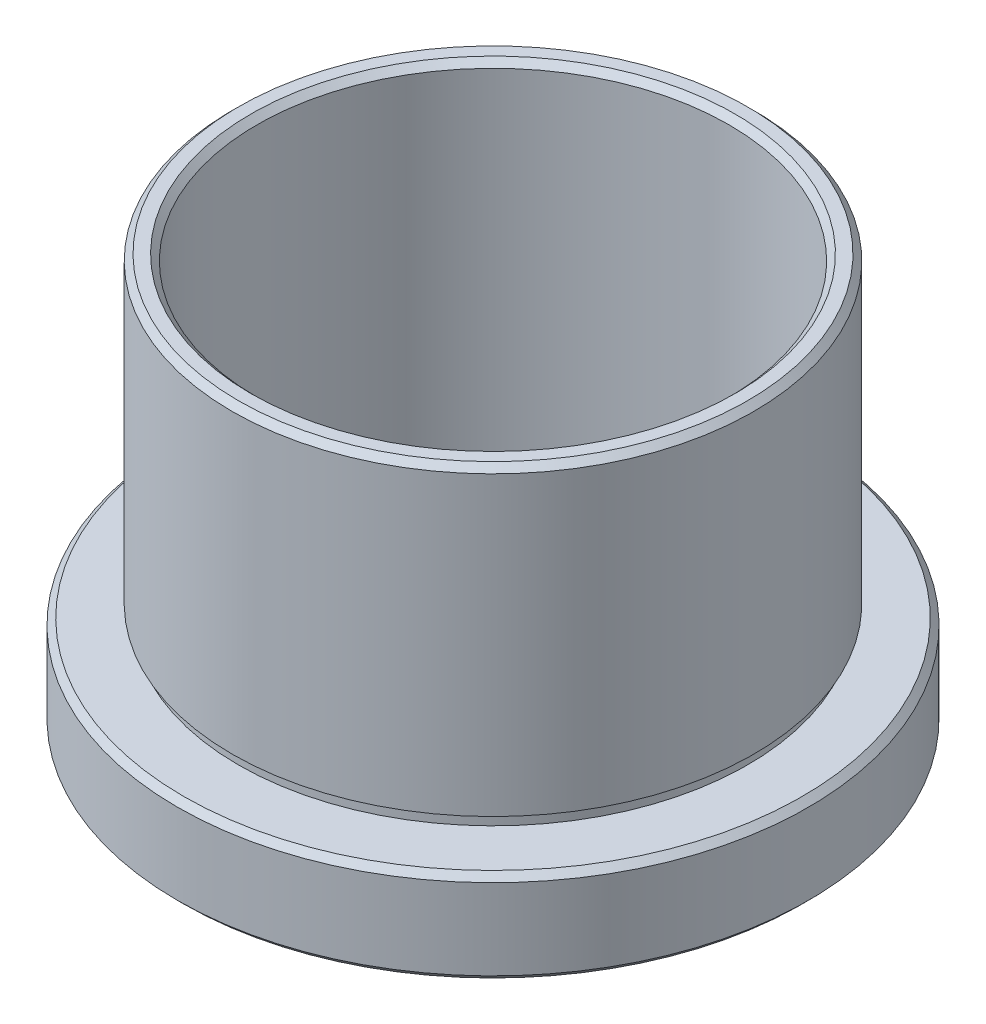
ISO-10303-21;
HEADER;
FILE_DESCRIPTION(('STEP AP214'),'2;1');
FILE_NAME('part.step','',(''),(''),'','','');
FILE_SCHEMA(('AUTOMOTIVE_DESIGN { 1 0 10303 214 1 1 1 1 }'));
ENDSEC;
DATA;
#1=APPLICATION_CONTEXT('core data for automotive mechanical design processes');
#2=APPLICATION_PROTOCOL_DEFINITION('international standard','automotive_design',2000,#1);
#3=PRODUCT_CONTEXT('',#1,'mechanical');
#4=PRODUCT('Part','Part','',(#3));
#5=PRODUCT_RELATED_PRODUCT_CATEGORY('part','',(#4));
#6=PRODUCT_DEFINITION_FORMATION('','',#4);
#7=PRODUCT_DEFINITION_CONTEXT('part definition',#1,'design');
#8=PRODUCT_DEFINITION('design','',#6,#7);
#9=PRODUCT_DEFINITION_SHAPE('','',#8);
#10=(LENGTH_UNIT() NAMED_UNIT(*) SI_UNIT(.MILLI.,.METRE.));
#11=(NAMED_UNIT(*) PLANE_ANGLE_UNIT() SI_UNIT($,.RADIAN.));
#12=(NAMED_UNIT(*) SI_UNIT($,.STERADIAN.) SOLID_ANGLE_UNIT());
#13=UNCERTAINTY_MEASURE_WITH_UNIT(LENGTH_MEASURE(1.E-05),#10,'distance_accuracy_value','');
#14=(GEOMETRIC_REPRESENTATION_CONTEXT(3) GLOBAL_UNCERTAINTY_ASSIGNED_CONTEXT((#13)) GLOBAL_UNIT_ASSIGNED_CONTEXT((#10,
#11,#12)) REPRESENTATION_CONTEXT('',''));
#15=CARTESIAN_POINT('',(0.,0.,0.));
#16=DIRECTION('',(0.,0.,1.));
#17=DIRECTION('',(1.,0.,0.));
#18=AXIS2_PLACEMENT_3D('',#15,#16,#17);
#19=CARTESIAN_POINT('',(21.,2.64285417456689,0.));
#20=DIRECTION('',(0.,1.,0.));
#21=DIRECTION('',(0.,0.,1.));
#22=AXIS2_PLACEMENT_3D('',#19,#20,#21);
#23=PLANE('',#22);
#24=CARTESIAN_POINT('',(0.,2.6428541745669,0.));
#25=DIRECTION('',(0.,1.,0.));
#26=DIRECTION('',(0.,0.,1.));
#27=AXIS2_PLACEMENT_3D('',#24,#25,#26);
#28=CIRCLE('',#27,21.);
#29=CARTESIAN_POINT('',(0.,2.6428541745669,21.));
#30=VERTEX_POINT('',#29);
#31=EDGE_CURVE('E12',#30,#30,#28,.T.);
#32=ORIENTED_EDGE('',*,*,#31,.F.);
#33=EDGE_LOOP('',(#32));
#34=FACE_BOUND('',#33,.T.);
#35=CARTESIAN_POINT('',(0.,2.6428541745669,0.));
#36=DIRECTION('',(0.,1.,0.));
#37=DIRECTION('',(0.,0.,1.));
#38=AXIS2_PLACEMENT_3D('',#35,#36,#37);
#39=CIRCLE('',#38,20.5);
#40=CARTESIAN_POINT('',(0.,2.6428541745669,20.5));
#41=VERTEX_POINT('',#40);
#42=EDGE_CURVE('E102',#41,#41,#39,.T.);
#43=ORIENTED_EDGE('',*,*,#42,.T.);
#44=EDGE_LOOP('',(#43));
#45=FACE_BOUND('',#44,.T.);
#46=ADVANCED_FACE('F47',(#34,#45),#23,.F.);
#47=CARTESIAN_POINT('',(0.,44.5985977452931,0.));
#48=DIRECTION('',(0.,1.,0.));
#49=DIRECTION('',(0.,0.,1.));
#50=AXIS2_PLACEMENT_3D('',#47,#48,#49);
#51=CYLINDRICAL_SURFACE('',#50,21.);
#52=CARTESIAN_POINT('',(0.,26.5428541745669,0.));
#53=DIRECTION('',(0.,1.,0.));
#54=DIRECTION('',(0.,0.,1.));
#55=AXIS2_PLACEMENT_3D('',#52,#53,#54);
#56=CIRCLE('',#55,21.);
#57=CARTESIAN_POINT('',(0.,26.5428541745669,21.));
#58=VERTEX_POINT('',#57);
#59=EDGE_CURVE('E53',#58,#58,#56,.T.);
#60=ORIENTED_EDGE('',*,*,#59,.F.);
#61=EDGE_LOOP('',(#60));
#62=FACE_BOUND('',#61,.T.);
#63=ORIENTED_EDGE('',*,*,#31,.T.);
#64=EDGE_LOOP('',(#63));
#65=FACE_BOUND('',#64,.T.);
#66=ADVANCED_FACE('F193',(#62,#65),#51,.T.);
#67=CARTESIAN_POINT('',(0.,26.5428541745669,0.));
#68=DIRECTION('',(0.,-1.,0.));
#69=DIRECTION('',(0.,0.,-1.));
#70=AXIS2_PLACEMENT_3D('',#67,#68,#69);
#71=CONICAL_SURFACE('',#70,21.,0.785398163397448);
#72=CARTESIAN_POINT('',(0.,27.0428541745669,0.));
#73=DIRECTION('',(0.,1.,0.));
#74=DIRECTION('',(0.,0.,1.));
#75=AXIS2_PLACEMENT_3D('',#72,#73,#74);
#76=CIRCLE('',#75,20.5);
#77=CARTESIAN_POINT('',(0.,27.0428541745669,20.5));
#78=VERTEX_POINT('',#77);
#79=EDGE_CURVE('E57',#78,#78,#76,.T.);
#80=ORIENTED_EDGE('',*,*,#79,.F.);
#81=EDGE_LOOP('',(#80));
#82=FACE_BOUND('',#81,.T.);
#83=ORIENTED_EDGE('',*,*,#59,.T.);
#84=EDGE_LOOP('',(#83));
#85=FACE_BOUND('',#84,.T.);
#86=ADVANCED_FACE('F188',(#82,#85),#71,.T.);
#87=CARTESIAN_POINT('',(19.5,27.0428541745669,0.));
#88=DIRECTION('',(0.,-1.,0.));
#89=DIRECTION('',(0.,0.,-1.));
#90=AXIS2_PLACEMENT_3D('',#87,#88,#89);
#91=PLANE('',#90);
#92=CARTESIAN_POINT('',(0.,27.0428541745669,0.));
#93=DIRECTION('',(0.,1.,0.));
#94=DIRECTION('',(0.,0.,1.));
#95=AXIS2_PLACEMENT_3D('',#92,#93,#94);
#96=CIRCLE('',#95,19.5);
#97=CARTESIAN_POINT('',(0.,27.0428541745669,19.5));
#98=VERTEX_POINT('',#97);
#99=EDGE_CURVE('E61',#98,#98,#96,.T.);
#100=ORIENTED_EDGE('',*,*,#99,.F.);
#101=EDGE_LOOP('',(#100));
#102=FACE_BOUND('',#101,.T.);
#103=ORIENTED_EDGE('',*,*,#79,.T.);
#104=EDGE_LOOP('',(#103));
#105=FACE_BOUND('',#104,.T.);
#106=ADVANCED_FACE('F182',(#102,#105),#91,.F.);
#107=CARTESIAN_POINT('',(0.,27.0428541745669,0.));
#108=DIRECTION('',(0.,1.,0.));
#109=DIRECTION('',(0.,0.,1.));
#110=AXIS2_PLACEMENT_3D('',#107,#108,#109);
#111=CONICAL_SURFACE('',#110,19.5,0.785398163397448);
#112=CARTESIAN_POINT('',(0.,26.5428541745669,0.));
#113=DIRECTION('',(0.,1.,0.));
#114=DIRECTION('',(0.,0.,1.));
#115=AXIS2_PLACEMENT_3D('',#112,#113,#114);
#116=CIRCLE('',#115,19.);
#117=CARTESIAN_POINT('',(0.,26.5428541745669,19.));
#118=VERTEX_POINT('',#117);
#119=EDGE_CURVE('E66',#118,#118,#116,.T.);
#120=ORIENTED_EDGE('',*,*,#119,.F.);
#121=EDGE_LOOP('',(#120));
#122=FACE_BOUND('',#121,.T.);
#123=ORIENTED_EDGE('',*,*,#99,.T.);
#124=EDGE_LOOP('',(#123));
#125=FACE_BOUND('',#124,.T.);
#126=ADVANCED_FACE('F176',(#122,#125),#111,.F.);
#127=CARTESIAN_POINT('',(0.,44.5985977452931,0.));
#128=DIRECTION('',(0.,1.,0.));
#129=DIRECTION('',(0.,0.,1.));
#130=AXIS2_PLACEMENT_3D('',#127,#128,#129);
#131=CYLINDRICAL_SURFACE('',#130,19.);
#132=CARTESIAN_POINT('',(0.,-0.357145825433107,0.));
#133=DIRECTION('',(0.,1.,0.));
#134=DIRECTION('',(0.,0.,1.));
#135=AXIS2_PLACEMENT_3D('',#132,#133,#134);
#136=CIRCLE('',#135,19.);
#137=CARTESIAN_POINT('',(0.,-0.357145825433107,19.));
#138=VERTEX_POINT('',#137);
#139=EDGE_CURVE('E69',#138,#138,#136,.T.);
#140=ORIENTED_EDGE('',*,*,#139,.F.);
#141=EDGE_LOOP('',(#140));
#142=FACE_BOUND('',#141,.T.);
#143=ORIENTED_EDGE('',*,*,#119,.T.);
#144=EDGE_LOOP('',(#143));
#145=FACE_BOUND('',#144,.T.);
#146=ADVANCED_FACE('F170',(#142,#145),#131,.F.);
#147=CARTESIAN_POINT('',(21.1,-0.357145825433106,0.));
#148=DIRECTION('',(0.,1.,0.));
#149=DIRECTION('',(0.,0.,1.));
#150=AXIS2_PLACEMENT_3D('',#147,#148,#149);
#151=PLANE('',#150);
#152=CARTESIAN_POINT('',(0.,-0.357145825433107,0.));
#153=DIRECTION('',(0.,1.,0.));
#154=DIRECTION('',(0.,0.,1.));
#155=AXIS2_PLACEMENT_3D('',#152,#153,#154);
#156=CIRCLE('',#155,21.1);
#157=CARTESIAN_POINT('',(0.,-0.357145825433107,21.1));
#158=VERTEX_POINT('',#157);
#159=EDGE_CURVE('E72',#158,#158,#156,.T.);
#160=ORIENTED_EDGE('',*,*,#159,.F.);
#161=EDGE_LOOP('',(#160));
#162=FACE_BOUND('',#161,.T.);
#163=ORIENTED_EDGE('',*,*,#139,.T.);
#164=EDGE_LOOP('',(#163));
#165=FACE_BOUND('',#164,.T.);
#166=ADVANCED_FACE('F164',(#162,#165),#151,.F.);
#167=CARTESIAN_POINT('',(0.,44.5985977452931,0.));
#168=DIRECTION('',(0.,1.,0.));
#169=DIRECTION('',(0.,0.,1.));
#170=AXIS2_PLACEMENT_3D('',#167,#168,#169);
#171=CYLINDRICAL_SURFACE('',#170,21.1);
#172=CARTESIAN_POINT('',(0.,-1.35714582543311,0.));
#173=DIRECTION('',(0.,1.,0.));
#174=DIRECTION('',(0.,0.,1.));
#175=AXIS2_PLACEMENT_3D('',#172,#173,#174);
#176=CIRCLE('',#175,21.1);
#177=CARTESIAN_POINT('',(0.,-1.35714582543311,21.1));
#178=VERTEX_POINT('',#177);
#179=EDGE_CURVE('E75',#178,#178,#176,.T.);
#180=ORIENTED_EDGE('',*,*,#179,.F.);
#181=EDGE_LOOP('',(#180));
#182=FACE_BOUND('',#181,.T.);
#183=ORIENTED_EDGE('',*,*,#159,.T.);
#184=EDGE_LOOP('',(#183));
#185=FACE_BOUND('',#184,.T.);
#186=ADVANCED_FACE('F158',(#182,#185),#171,.F.);
#187=CARTESIAN_POINT('',(21.,-1.35714582543311,0.));
#188=DIRECTION('',(0.,-1.,0.));
#189=DIRECTION('',(0.,0.,-1.));
#190=AXIS2_PLACEMENT_3D('',#187,#188,#189);
#191=PLANE('',#190);
#192=CARTESIAN_POINT('',(0.,-1.35714582543311,0.));
#193=DIRECTION('',(0.,1.,0.));
#194=DIRECTION('',(0.,0.,1.));
#195=AXIS2_PLACEMENT_3D('',#192,#193,#194);
#196=CIRCLE('',#195,21.);
#197=CARTESIAN_POINT('',(0.,-1.35714582543311,21.));
#198=VERTEX_POINT('',#197);
#199=EDGE_CURVE('E78',#198,#198,#196,.T.);
#200=ORIENTED_EDGE('',*,*,#199,.F.);
#201=EDGE_LOOP('',(#200));
#202=FACE_BOUND('',#201,.T.);
#203=ORIENTED_EDGE('',*,*,#179,.T.);
#204=EDGE_LOOP('',(#203));
#205=FACE_BOUND('',#204,.T.);
#206=ADVANCED_FACE('F152',(#202,#205),#191,.F.);
#207=CARTESIAN_POINT('',(0.,44.5985977452931,0.));
#208=DIRECTION('',(0.,1.,0.));
#209=DIRECTION('',(0.,0.,1.));
#210=AXIS2_PLACEMENT_3D('',#207,#208,#209);
#211=CYLINDRICAL_SURFACE('',#210,21.);
#212=CARTESIAN_POINT('',(0.,-5.3571458254331,0.));
#213=DIRECTION('',(0.,1.,0.));
#214=DIRECTION('',(0.,0.,1.));
#215=AXIS2_PLACEMENT_3D('',#212,#213,#214);
#216=CIRCLE('',#215,21.);
#217=CARTESIAN_POINT('',(0.,-5.3571458254331,21.));
#218=VERTEX_POINT('',#217);
#219=EDGE_CURVE('E81',#218,#218,#216,.T.);
#220=ORIENTED_EDGE('',*,*,#219,.F.);
#221=EDGE_LOOP('',(#220));
#222=FACE_BOUND('',#221,.T.);
#223=ORIENTED_EDGE('',*,*,#199,.T.);
#224=EDGE_LOOP('',(#223));
#225=FACE_BOUND('',#224,.T.);
#226=ADVANCED_FACE('F146',(#222,#225),#211,.F.);
#227=CARTESIAN_POINT('',(0.,-5.3571458254331,0.));
#228=DIRECTION('',(0.,-1.,0.));
#229=DIRECTION('',(0.,0.,-1.));
#230=AXIS2_PLACEMENT_3D('',#227,#228,#229);
#231=CONICAL_SURFACE('',#230,21.,0.785398163397448);
#232=CARTESIAN_POINT('',(0.,-5.85714582543311,0.));
#233=DIRECTION('',(0.,1.,0.));
#234=DIRECTION('',(0.,0.,1.));
#235=AXIS2_PLACEMENT_3D('',#232,#233,#234);
#236=CIRCLE('',#235,21.5);
#237=CARTESIAN_POINT('',(0.,-5.85714582543311,21.5));
#238=VERTEX_POINT('',#237);
#239=EDGE_CURVE('E84',#238,#238,#236,.T.);
#240=ORIENTED_EDGE('',*,*,#239,.F.);
#241=EDGE_LOOP('',(#240));
#242=FACE_BOUND('',#241,.T.);
#243=ORIENTED_EDGE('',*,*,#219,.T.);
#244=EDGE_LOOP('',(#243));
#245=FACE_BOUND('',#244,.T.);
#246=ADVANCED_FACE('F140',(#242,#245),#231,.F.);
#247=CARTESIAN_POINT('',(24.9,-5.85714582543311,0.));
#248=DIRECTION('',(0.,1.,0.));
#249=DIRECTION('',(0.,0.,1.));
#250=AXIS2_PLACEMENT_3D('',#247,#248,#249);
#251=PLANE('',#250);
#252=CARTESIAN_POINT('',(0.,-5.85714582543311,0.));
#253=DIRECTION('',(0.,1.,0.));
#254=DIRECTION('',(0.,0.,1.));
#255=AXIS2_PLACEMENT_3D('',#252,#253,#254);
#256=CIRCLE('',#255,24.9);
#257=CARTESIAN_POINT('',(0.,-5.85714582543311,24.9));
#258=VERTEX_POINT('',#257);
#259=EDGE_CURVE('E87',#258,#258,#256,.T.);
#260=ORIENTED_EDGE('',*,*,#259,.F.);
#261=EDGE_LOOP('',(#260));
#262=FACE_BOUND('',#261,.T.);
#263=ORIENTED_EDGE('',*,*,#239,.T.);
#264=EDGE_LOOP('',(#263));
#265=FACE_BOUND('',#264,.T.);
#266=ADVANCED_FACE('F134',(#262,#265),#251,.F.);
#267=CARTESIAN_POINT('',(0.,-5.85714582543311,0.));
#268=DIRECTION('',(0.,1.,0.));
#269=DIRECTION('',(0.,0.,1.));
#270=AXIS2_PLACEMENT_3D('',#267,#268,#269);
#271=CONICAL_SURFACE('',#270,24.9,0.785398163397452);
#272=CARTESIAN_POINT('',(0.,-5.3571458254331,0.));
#273=DIRECTION('',(0.,1.,0.));
#274=DIRECTION('',(0.,0.,1.));
#275=AXIS2_PLACEMENT_3D('',#272,#273,#274);
#276=CIRCLE('',#275,25.4);
#277=CARTESIAN_POINT('',(0.,-5.3571458254331,25.4));
#278=VERTEX_POINT('',#277);
#279=EDGE_CURVE('E90',#278,#278,#276,.T.);
#280=ORIENTED_EDGE('',*,*,#279,.F.);
#281=EDGE_LOOP('',(#280));
#282=FACE_BOUND('',#281,.T.);
#283=ORIENTED_EDGE('',*,*,#259,.T.);
#284=EDGE_LOOP('',(#283));
#285=FACE_BOUND('',#284,.T.);
#286=ADVANCED_FACE('F128',(#282,#285),#271,.T.);
#287=CARTESIAN_POINT('',(0.,44.5985977452931,0.));
#288=DIRECTION('',(0.,1.,0.));
#289=DIRECTION('',(0.,0.,1.));
#290=AXIS2_PLACEMENT_3D('',#287,#288,#289);
#291=CYLINDRICAL_SURFACE('',#290,25.4);
#292=CARTESIAN_POINT('',(0.,1.14285417456689,0.));
#293=DIRECTION('',(0.,1.,0.));
#294=DIRECTION('',(0.,0.,1.));
#295=AXIS2_PLACEMENT_3D('',#292,#293,#294);
#296=CIRCLE('',#295,25.4);
#297=CARTESIAN_POINT('',(0.,1.14285417456689,25.4));
#298=VERTEX_POINT('',#297);
#299=EDGE_CURVE('E93',#298,#298,#296,.T.);
#300=ORIENTED_EDGE('',*,*,#299,.F.);
#301=EDGE_LOOP('',(#300));
#302=FACE_BOUND('',#301,.T.);
#303=ORIENTED_EDGE('',*,*,#279,.T.);
#304=EDGE_LOOP('',(#303));
#305=FACE_BOUND('',#304,.T.);
#306=ADVANCED_FACE('F122',(#302,#305),#291,.T.);
#307=CARTESIAN_POINT('',(0.,1.14285417456689,0.));
#308=DIRECTION('',(0.,-1.,0.));
#309=DIRECTION('',(0.,0.,-1.));
#310=AXIS2_PLACEMENT_3D('',#307,#308,#309);
#311=CONICAL_SURFACE('',#310,25.4,0.785398163397452);
#312=CARTESIAN_POINT('',(0.,1.64285417456689,0.));
#313=DIRECTION('',(0.,1.,0.));
#314=DIRECTION('',(0.,0.,1.));
#315=AXIS2_PLACEMENT_3D('',#312,#313,#314);
#316=CIRCLE('',#315,24.9);
#317=CARTESIAN_POINT('',(0.,1.64285417456689,24.9));
#318=VERTEX_POINT('',#317);
#319=EDGE_CURVE('E96',#318,#318,#316,.T.);
#320=ORIENTED_EDGE('',*,*,#319,.F.);
#321=EDGE_LOOP('',(#320));
#322=FACE_BOUND('',#321,.T.);
#323=ORIENTED_EDGE('',*,*,#299,.T.);
#324=EDGE_LOOP('',(#323));
#325=FACE_BOUND('',#324,.T.);
#326=ADVANCED_FACE('F116',(#322,#325),#311,.T.);
#327=CARTESIAN_POINT('',(20.5,1.64285417456689,0.));
#328=DIRECTION('',(0.,-1.,0.));
#329=DIRECTION('',(0.,0.,-1.));
#330=AXIS2_PLACEMENT_3D('',#327,#328,#329);
#331=PLANE('',#330);
#332=CARTESIAN_POINT('',(0.,1.64285417456689,0.));
#333=DIRECTION('',(0.,1.,0.));
#334=DIRECTION('',(0.,0.,1.));
#335=AXIS2_PLACEMENT_3D('',#332,#333,#334);
#336=CIRCLE('',#335,20.5);
#337=CARTESIAN_POINT('',(0.,1.64285417456689,20.5));
#338=VERTEX_POINT('',#337);
#339=EDGE_CURVE('E99',#338,#338,#336,.T.);
#340=ORIENTED_EDGE('',*,*,#339,.F.);
#341=EDGE_LOOP('',(#340));
#342=FACE_BOUND('',#341,.T.);
#343=ORIENTED_EDGE('',*,*,#319,.T.);
#344=EDGE_LOOP('',(#343));
#345=FACE_BOUND('',#344,.T.);
#346=ADVANCED_FACE('F110',(#342,#345),#331,.F.);
#347=CARTESIAN_POINT('',(0.,44.5985977452931,0.));
#348=DIRECTION('',(0.,1.,0.));
#349=DIRECTION('',(0.,0.,1.));
#350=AXIS2_PLACEMENT_3D('',#347,#348,#349);
#351=CYLINDRICAL_SURFACE('',#350,20.5);
#352=ORIENTED_EDGE('',*,*,#42,.F.);
#353=EDGE_LOOP('',(#352));
#354=FACE_BOUND('',#353,.T.);
#355=ORIENTED_EDGE('',*,*,#339,.T.);
#356=EDGE_LOOP('',(#355));
#357=FACE_BOUND('',#356,.T.);
#358=ADVANCED_FACE('F107',(#354,#357),#351,.T.);
#359=CLOSED_SHELL('',(#46,#66,#86,#106,#126,#146,#166,#186,#206,#226,#246,#266,#286,#306,#326,
#346,#358));
#360=MANIFOLD_SOLID_BREP('B2',#359);
#361=ADVANCED_BREP_SHAPE_REPRESENTATION('',(#18,#360),#14);
#362=SHAPE_DEFINITION_REPRESENTATION(#9,#361);
ENDSEC;
END-ISO-10303-21;
